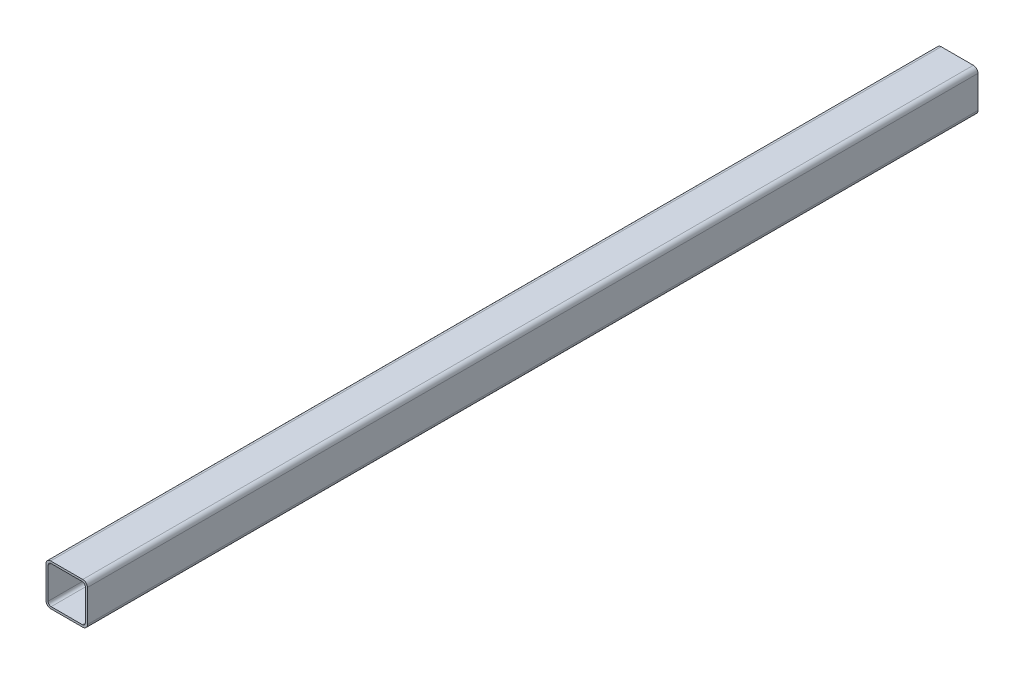
ISO-10303-21;
HEADER;
FILE_DESCRIPTION(('STEP AP214'),'2;1');
FILE_NAME('part.step','',(''),(''),'','','');
FILE_SCHEMA(('AUTOMOTIVE_DESIGN { 1 0 10303 214 1 1 1 1 }'));
ENDSEC;
DATA;
#1=APPLICATION_CONTEXT('core data for automotive mechanical design processes');
#2=APPLICATION_PROTOCOL_DEFINITION('international standard','automotive_design',2000,#1);
#3=PRODUCT_CONTEXT('',#1,'mechanical');
#4=PRODUCT('Part','Part','',(#3));
#5=PRODUCT_RELATED_PRODUCT_CATEGORY('part','',(#4));
#6=PRODUCT_DEFINITION_FORMATION('','',#4);
#7=PRODUCT_DEFINITION_CONTEXT('part definition',#1,'design');
#8=PRODUCT_DEFINITION('design','',#6,#7);
#9=PRODUCT_DEFINITION_SHAPE('','',#8);
#10=(LENGTH_UNIT() NAMED_UNIT(*) SI_UNIT(.MILLI.,.METRE.));
#11=(NAMED_UNIT(*) PLANE_ANGLE_UNIT() SI_UNIT($,.RADIAN.));
#12=(NAMED_UNIT(*) SI_UNIT($,.STERADIAN.) SOLID_ANGLE_UNIT());
#13=UNCERTAINTY_MEASURE_WITH_UNIT(LENGTH_MEASURE(1.E-05),#10,'distance_accuracy_value','');
#14=(GEOMETRIC_REPRESENTATION_CONTEXT(3) GLOBAL_UNCERTAINTY_ASSIGNED_CONTEXT((#13)) GLOBAL_UNIT_ASSIGNED_CONTEXT((#10,
#11,#12)) REPRESENTATION_CONTEXT('',''));
#15=CARTESIAN_POINT('',(0.,0.,0.));
#16=DIRECTION('',(0.,0.,1.));
#17=DIRECTION('',(1.,0.,0.));
#18=AXIS2_PLACEMENT_3D('',#15,#16,#17);
#19=CARTESIAN_POINT('',(-14.9999999999997,1532.00000000001,-900.000000000004));
#20=DIRECTION('',(0.,0.,1.));
#21=DIRECTION('',(0.999999999999997,0.,0.));
#22=AXIS2_PLACEMENT_3D('',#19,#20,#21);
#23=CYLINDRICAL_SURFACE('',#22,3.);
#24=DIRECTION('',(0.,0.,1.));
#25=VECTOR('',#24,1.);
#26=CARTESIAN_POINT('',(-14.9999999999997,1529.00000000001,-900.000000000004));
#27=LINE('',#26,#25);
#28=CARTESIAN_POINT('',(-14.9999999999997,1529.00000000001,-880.000000000004));
#29=VERTEX_POINT('',#28);
#30=CARTESIAN_POINT('',(-14.9999999999997,1529.00000000001,-20.0000000000049));
#31=VERTEX_POINT('',#30);
#32=EDGE_CURVE('E240',#29,#31,#27,.T.);
#33=ORIENTED_EDGE('',*,*,#32,.F.);
#34=CARTESIAN_POINT('',(-14.9999999999997,1532.00000000001,-880.000000000004));
#35=DIRECTION('',(0.,0.,-1.));
#36=DIRECTION('',(0.,1.00000000000001,0.));
#37=AXIS2_PLACEMENT_3D('',#34,#35,#36);
#38=CIRCLE('',#37,3.);
#39=CARTESIAN_POINT('',(-17.9999999999996,1532.00000000001,-880.000000000004));
#40=VERTEX_POINT('',#39);
#41=EDGE_CURVE('E232',#29,#40,#38,.T.);
#42=ORIENTED_EDGE('',*,*,#41,.T.);
#43=DIRECTION('',(0.,0.,1.));
#44=VECTOR('',#43,1.);
#45=CARTESIAN_POINT('',(-17.9999999999998,1532.00000000001,-900.000000000004));
#46=LINE('',#45,#44);
#47=CARTESIAN_POINT('',(-17.9999999999998,1532.00000000001,-20.0000000000029));
#48=VERTEX_POINT('',#47);
#49=EDGE_CURVE('E46',#40,#48,#46,.T.);
#50=ORIENTED_EDGE('',*,*,#49,.T.);
#51=CARTESIAN_POINT('',(-14.9999999999997,1532.00000000001,-20.0000000000049));
#52=DIRECTION('',(0.,0.,1.));
#53=DIRECTION('',(0.999999999999997,0.,0.));
#54=AXIS2_PLACEMENT_3D('',#51,#52,#53);
#55=CIRCLE('',#54,3.);
#56=EDGE_CURVE('E198',#48,#31,#55,.T.);
#57=ORIENTED_EDGE('',*,*,#56,.T.);
#58=EDGE_LOOP('',(#33,#42,#50,#57));
#59=FACE_BOUND('',#58,.T.);
#60=ADVANCED_FACE('F43',(#59),#23,.F.);
#61=CARTESIAN_POINT('',(-14.9999999999997,1529.00000000001,-900.000000000004));
#62=DIRECTION('',(0.,1.00000000000001,0.));
#63=DIRECTION('',(0.,0.,1.));
#64=AXIS2_PLACEMENT_3D('',#61,#62,#63);
#65=PLANE('',#64);
#66=DIRECTION('',(0.,0.,1.));
#67=VECTOR('',#66,1.);
#68=CARTESIAN_POINT('',(15.0000000000003,1529.00000000001,-900.000000000004));
#69=LINE('',#68,#67);
#70=CARTESIAN_POINT('',(15.0000000000003,1529.00000000001,-880.000000000004));
#71=VERTEX_POINT('',#70);
#72=CARTESIAN_POINT('',(15.0000000000003,1529.00000000001,-20.0000000000029));
#73=VERTEX_POINT('',#72);
#74=EDGE_CURVE('E245',#71,#73,#69,.T.);
#75=ORIENTED_EDGE('',*,*,#74,.F.);
#76=DIRECTION('',(-0.999999999999997,0.,0.));
#77=VECTOR('',#76,1.);
#78=CARTESIAN_POINT('',(-14.9999999999997,1529.00000000001,-880.000000000004));
#79=LINE('',#78,#77);
#80=EDGE_CURVE('E236',#71,#29,#79,.T.);
#81=ORIENTED_EDGE('',*,*,#80,.T.);
#82=ORIENTED_EDGE('',*,*,#32,.T.);
#83=DIRECTION('',(0.999999999999997,0.,0.));
#84=VECTOR('',#83,1.);
#85=CARTESIAN_POINT('',(-14.9999999999997,1529.00000000001,-20.0000000000049));
#86=LINE('',#85,#84);
#87=EDGE_CURVE('E246',#31,#73,#86,.T.);
#88=ORIENTED_EDGE('',*,*,#87,.T.);
#89=EDGE_LOOP('',(#75,#81,#82,#88));
#90=FACE_BOUND('',#89,.T.);
#91=ADVANCED_FACE('F415',(#90),#65,.T.);
#92=CARTESIAN_POINT('',(15.0000000000003,1532.00000000001,-900.000000000004));
#93=DIRECTION('',(0.,0.,1.));
#94=DIRECTION('',(0.999999999999997,0.,0.));
#95=AXIS2_PLACEMENT_3D('',#92,#93,#94);
#96=CYLINDRICAL_SURFACE('',#95,3.);
#97=DIRECTION('',(0.,0.,1.));
#98=VECTOR('',#97,1.);
#99=CARTESIAN_POINT('',(18.0000000000002,1532.00000000001,-900.000000000004));
#100=LINE('',#99,#98);
#101=CARTESIAN_POINT('',(18.0000000000002,1532.00000000001,-880.000000000004));
#102=VERTEX_POINT('',#101);
#103=CARTESIAN_POINT('',(18.0000000000002,1532.00000000001,-20.0000000000029));
#104=VERTEX_POINT('',#103);
#105=EDGE_CURVE('E251',#102,#104,#100,.T.);
#106=ORIENTED_EDGE('',*,*,#105,.F.);
#107=CARTESIAN_POINT('',(15.0000000000003,1532.00000000001,-880.000000000004));
#108=DIRECTION('',(0.,0.,-1.));
#109=DIRECTION('',(0.,1.00000000000001,0.));
#110=AXIS2_PLACEMENT_3D('',#107,#108,#109);
#111=CIRCLE('',#110,3.);
#112=EDGE_CURVE('E241',#102,#71,#111,.T.);
#113=ORIENTED_EDGE('',*,*,#112,.T.);
#114=ORIENTED_EDGE('',*,*,#74,.T.);
#115=CARTESIAN_POINT('',(15.0000000000003,1532.00000000001,-20.0000000000029));
#116=DIRECTION('',(0.,0.,1.));
#117=DIRECTION('',(0.999999999999997,0.,0.));
#118=AXIS2_PLACEMENT_3D('',#115,#116,#117);
#119=CIRCLE('',#118,3.);
#120=EDGE_CURVE('E252',#73,#104,#119,.T.);
#121=ORIENTED_EDGE('',*,*,#120,.T.);
#122=EDGE_LOOP('',(#106,#113,#114,#121));
#123=FACE_BOUND('',#122,.T.);
#124=ADVANCED_FACE('F360',(#123),#96,.F.);
#125=CARTESIAN_POINT('',(18.0000000000002,1532.00000000001,-900.000000000004));
#126=DIRECTION('',(-0.999999999999997,0.,0.));
#127=DIRECTION('',(0.,0.,1.));
#128=AXIS2_PLACEMENT_3D('',#125,#126,#127);
#129=PLANE('',#128);
#130=DIRECTION('',(0.,0.,1.));
#131=VECTOR('',#130,1.);
#132=CARTESIAN_POINT('',(18.,1562.00000000001,-900.000000000004));
#133=LINE('',#132,#131);
#134=CARTESIAN_POINT('',(18.,1562.00000000001,-880.000000000004));
#135=VERTEX_POINT('',#134);
#136=CARTESIAN_POINT('',(18.0000000000002,1562.00000000001,-20.0000000000029));
#137=VERTEX_POINT('',#136);
#138=EDGE_CURVE('E257',#135,#137,#133,.T.);
#139=ORIENTED_EDGE('',*,*,#138,.F.);
#140=DIRECTION('',(0.,-1.00000000000001,0.));
#141=VECTOR('',#140,1.);
#142=CARTESIAN_POINT('',(18.0000000000002,1532.00000000001,-880.000000000004));
#143=LINE('',#142,#141);
#144=EDGE_CURVE('E247',#135,#102,#143,.T.);
#145=ORIENTED_EDGE('',*,*,#144,.T.);
#146=ORIENTED_EDGE('',*,*,#105,.T.);
#147=DIRECTION('',(0.,1.00000000000001,0.));
#148=VECTOR('',#147,1.);
#149=CARTESIAN_POINT('',(18.0000000000002,1532.00000000001,-20.0000000000029));
#150=LINE('',#149,#148);
#151=EDGE_CURVE('E258',#104,#137,#150,.T.);
#152=ORIENTED_EDGE('',*,*,#151,.T.);
#153=EDGE_LOOP('',(#139,#145,#146,#152));
#154=FACE_BOUND('',#153,.T.);
#155=ADVANCED_FACE('F357',(#154),#129,.T.);
#156=CARTESIAN_POINT('',(14.9999999999999,1562.00000000001,-900.000000000004));
#157=DIRECTION('',(0.,0.,1.));
#158=DIRECTION('',(0.999999999999997,0.,0.));
#159=AXIS2_PLACEMENT_3D('',#156,#157,#158);
#160=CYLINDRICAL_SURFACE('',#159,3.);
#161=DIRECTION('',(0.,0.,1.));
#162=VECTOR('',#161,1.);
#163=CARTESIAN_POINT('',(14.9999999999999,1565.00000000001,-900.000000000004));
#164=LINE('',#163,#162);
#165=CARTESIAN_POINT('',(15.0000000000001,1565.00000000001,-880.000000000004));
#166=VERTEX_POINT('',#165);
#167=CARTESIAN_POINT('',(15.0000000000001,1565.00000000001,-20.0000000000029));
#168=VERTEX_POINT('',#167);
#169=EDGE_CURVE('E261',#166,#168,#164,.T.);
#170=ORIENTED_EDGE('',*,*,#169,.F.);
#171=CARTESIAN_POINT('',(15.0000000000001,1562.00000000001,-880.000000000004));
#172=DIRECTION('',(0.,0.,-1.));
#173=DIRECTION('',(0.,1.00000000000001,0.));
#174=AXIS2_PLACEMENT_3D('',#171,#172,#173);
#175=CIRCLE('',#174,3.);
#176=EDGE_CURVE('E253',#166,#135,#175,.T.);
#177=ORIENTED_EDGE('',*,*,#176,.T.);
#178=ORIENTED_EDGE('',*,*,#138,.T.);
#179=CARTESIAN_POINT('',(15.0000000000001,1562.00000000001,-20.0000000000029));
#180=DIRECTION('',(0.,0.,1.));
#181=DIRECTION('',(0.999999999999997,0.,0.));
#182=AXIS2_PLACEMENT_3D('',#179,#180,#181);
#183=CIRCLE('',#182,3.);
#184=EDGE_CURVE('E262',#137,#168,#183,.T.);
#185=ORIENTED_EDGE('',*,*,#184,.T.);
#186=EDGE_LOOP('',(#170,#177,#178,#185));
#187=FACE_BOUND('',#186,.T.);
#188=ADVANCED_FACE('F352',(#187),#160,.F.);
#189=CARTESIAN_POINT('',(-15.0000000000001,1565.00000000001,-900.000000000004));
#190=DIRECTION('',(0.,-1.00000000000001,0.));
#191=DIRECTION('',(0.,0.,-1.));
#192=AXIS2_PLACEMENT_3D('',#189,#190,#191);
#193=PLANE('',#192);
#194=DIRECTION('',(0.,0.,1.));
#195=VECTOR('',#194,1.);
#196=CARTESIAN_POINT('',(-15.0000000000001,1565.00000000001,-900.000000000004));
#197=LINE('',#196,#195);
#198=CARTESIAN_POINT('',(-14.9999999999997,1565.00000000001,-880.000000000004));
#199=VERTEX_POINT('',#198);
#200=CARTESIAN_POINT('',(-14.9999999999999,1565.00000000001,-20.0000000000049));
#201=VERTEX_POINT('',#200);
#202=EDGE_CURVE('E265',#199,#201,#197,.T.);
#203=ORIENTED_EDGE('',*,*,#202,.F.);
#204=DIRECTION('',(0.999999999999997,0.,0.));
#205=VECTOR('',#204,1.);
#206=CARTESIAN_POINT('',(-14.9999999999997,1565.00000000001,-880.000000000004));
#207=LINE('',#206,#205);
#208=EDGE_CURVE('E106',#199,#166,#207,.T.);
#209=ORIENTED_EDGE('',*,*,#208,.T.);
#210=ORIENTED_EDGE('',*,*,#169,.T.);
#211=DIRECTION('',(-0.999999999999997,0.,0.));
#212=VECTOR('',#211,1.);
#213=CARTESIAN_POINT('',(-14.9999999999999,1565.00000000001,-20.0000000000049));
#214=LINE('',#213,#212);
#215=EDGE_CURVE('E266',#168,#201,#214,.T.);
#216=ORIENTED_EDGE('',*,*,#215,.T.);
#217=EDGE_LOOP('',(#203,#209,#210,#216));
#218=FACE_BOUND('',#217,.T.);
#219=ADVANCED_FACE('F349',(#218),#193,.T.);
#220=CARTESIAN_POINT('',(-15.0000000000001,1562.00000000001,-900.000000000004));
#221=DIRECTION('',(0.,0.,1.));
#222=DIRECTION('',(0.999999999999997,0.,0.));
#223=AXIS2_PLACEMENT_3D('',#220,#221,#222);
#224=CYLINDRICAL_SURFACE('',#223,3.);
#225=DIRECTION('',(0.,0.,1.));
#226=VECTOR('',#225,1.);
#227=CARTESIAN_POINT('',(-18.,1562.00000000001,-900.000000000004));
#228=LINE('',#227,#226);
#229=CARTESIAN_POINT('',(-17.9999999999998,1562.00000000001,-880.000000000004));
#230=VERTEX_POINT('',#229);
#231=CARTESIAN_POINT('',(-17.9999999999998,1562.00000000001,-20.0000000000029));
#232=VERTEX_POINT('',#231);
#233=EDGE_CURVE('E216',#230,#232,#228,.T.);
#234=ORIENTED_EDGE('',*,*,#233,.F.);
#235=CARTESIAN_POINT('',(-14.9999999999997,1562.00000000001,-880.000000000004));
#236=DIRECTION('',(0.,0.,-1.));
#237=DIRECTION('',(0.,1.00000000000001,0.));
#238=AXIS2_PLACEMENT_3D('',#235,#236,#237);
#239=CIRCLE('',#238,3.);
#240=EDGE_CURVE('E110',#230,#199,#239,.T.);
#241=ORIENTED_EDGE('',*,*,#240,.T.);
#242=ORIENTED_EDGE('',*,*,#202,.T.);
#243=CARTESIAN_POINT('',(-14.9999999999999,1562.00000000001,-20.0000000000049));
#244=DIRECTION('',(0.,0.,1.));
#245=DIRECTION('',(0.999999999999997,0.,0.));
#246=AXIS2_PLACEMENT_3D('',#243,#244,#245);
#247=CIRCLE('',#246,3.);
#248=EDGE_CURVE('E173',#201,#232,#247,.T.);
#249=ORIENTED_EDGE('',*,*,#248,.T.);
#250=EDGE_LOOP('',(#234,#241,#242,#249));
#251=FACE_BOUND('',#250,.T.);
#252=ADVANCED_FACE('F341',(#251),#224,.F.);
#253=CARTESIAN_POINT('',(-15.4999999999996,1531.50000000001,-900.000000000004));
#254=DIRECTION('',(0.,0.,1.));
#255=DIRECTION('',(0.999999999999997,0.,0.));
#256=AXIS2_PLACEMENT_3D('',#253,#254,#255);
#257=CYLINDRICAL_SURFACE('',#256,4.5);
#258=CARTESIAN_POINT('',(-15.4999999999996,1531.50000000001,-880.000000000004));
#259=DIRECTION('',(0.,0.,-1.));
#260=DIRECTION('',(0.,1.00000000000001,0.));
#261=AXIS2_PLACEMENT_3D('',#258,#259,#260);
#262=CIRCLE('',#261,4.5);
#263=CARTESIAN_POINT('',(-15.4999999999996,1527.00000000001,-880.000000000004));
#264=VERTEX_POINT('',#263);
#265=CARTESIAN_POINT('',(-19.9999999999996,1531.50000000001,-880.000000000003));
#266=VERTEX_POINT('',#265);
#267=EDGE_CURVE('E53',#264,#266,#262,.T.);
#268=ORIENTED_EDGE('',*,*,#267,.F.);
#269=DIRECTION('',(0.,0.,1.));
#270=VECTOR('',#269,1.);
#271=CARTESIAN_POINT('',(-15.4999999999998,1527.00000000001,-900.000000000004));
#272=LINE('',#271,#270);
#273=CARTESIAN_POINT('',(-15.4999999999998,1527.00000000001,-20.0000000000029));
#274=VERTEX_POINT('',#273);
#275=EDGE_CURVE('E163',#264,#274,#272,.T.);
#276=ORIENTED_EDGE('',*,*,#275,.T.);
#277=CARTESIAN_POINT('',(-15.4999999999996,1531.50000000001,-20.0000000000029));
#278=DIRECTION('',(0.,0.,1.));
#279=DIRECTION('',(0.999999999999997,0.,0.));
#280=AXIS2_PLACEMENT_3D('',#277,#278,#279);
#281=CIRCLE('',#280,4.5);
#282=CARTESIAN_POINT('',(-19.9999999999998,1531.50000000001,-20.0000000000051));
#283=VERTEX_POINT('',#282);
#284=EDGE_CURVE('E167',#283,#274,#281,.T.);
#285=ORIENTED_EDGE('',*,*,#284,.F.);
#286=DIRECTION('',(0.,0.,1.));
#287=VECTOR('',#286,1.);
#288=CARTESIAN_POINT('',(-19.9999999999998,1531.50000000001,-900.000000000003));
#289=LINE('',#288,#287);
#290=EDGE_CURVE('E172',#266,#283,#289,.T.);
#291=ORIENTED_EDGE('',*,*,#290,.F.);
#292=EDGE_LOOP('',(#268,#276,#285,#291));
#293=FACE_BOUND('',#292,.T.);
#294=ADVANCED_FACE('F165',(#293),#257,.T.);
#295=CARTESIAN_POINT('',(-19.9999999999998,1531.50000000001,-900.000000000003));
#296=DIRECTION('',(0.999999999999997,0.,0.));
#297=DIRECTION('',(0.,0.,-1.));
#298=AXIS2_PLACEMENT_3D('',#295,#296,#297);
#299=PLANE('',#298);
#300=DIRECTION('',(0.,1.00000000000001,0.));
#301=VECTOR('',#300,1.);
#302=CARTESIAN_POINT('',(-20.,1.4432899320127E-12,-880.000000000001));
#303=LINE('',#302,#301);
#304=CARTESIAN_POINT('',(-19.9999999999998,1562.50000000001,-880.000000000003));
#305=VERTEX_POINT('',#304);
#306=EDGE_CURVE('E11',#266,#305,#303,.T.);
#307=ORIENTED_EDGE('',*,*,#306,.F.);
#308=ORIENTED_EDGE('',*,*,#290,.T.);
#309=DIRECTION('',(0.,-1.00000000000001,0.));
#310=VECTOR('',#309,1.);
#311=CARTESIAN_POINT('',(-19.9999999999998,1960.00000000001,-20.0000000000053));
#312=LINE('',#311,#310);
#313=CARTESIAN_POINT('',(-19.9999999999998,1562.50000000001,-20.0000000000051));
#314=VERTEX_POINT('',#313);
#315=EDGE_CURVE('E184',#314,#283,#312,.T.);
#316=ORIENTED_EDGE('',*,*,#315,.F.);
#317=DIRECTION('',(0.,0.,1.));
#318=VECTOR('',#317,1.);
#319=CARTESIAN_POINT('',(-20.,1562.50000000001,-900.000000000003));
#320=LINE('',#319,#318);
#321=EDGE_CURVE('E288',#305,#314,#320,.T.);
#322=ORIENTED_EDGE('',*,*,#321,.F.);
#323=EDGE_LOOP('',(#307,#308,#316,#322));
#324=FACE_BOUND('',#323,.T.);
#325=ADVANCED_FACE('F436',(#324),#299,.F.);
#326=CARTESIAN_POINT('',(-15.5000000000001,1562.50000000001,-900.000000000004));
#327=DIRECTION('',(0.,0.,1.));
#328=DIRECTION('',(0.999999999999997,0.,0.));
#329=AXIS2_PLACEMENT_3D('',#326,#327,#328);
#330=CYLINDRICAL_SURFACE('',#329,4.5);
#331=CARTESIAN_POINT('',(-15.4999999999998,1562.50000000001,-880.000000000004));
#332=DIRECTION('',(0.,0.,-1.));
#333=DIRECTION('',(0.,1.00000000000001,0.));
#334=AXIS2_PLACEMENT_3D('',#331,#332,#333);
#335=CIRCLE('',#334,4.5);
#336=CARTESIAN_POINT('',(-15.4999999999998,1567.00000000001,-880.000000000004));
#337=VERTEX_POINT('',#336);
#338=EDGE_CURVE('E208',#305,#337,#335,.T.);
#339=ORIENTED_EDGE('',*,*,#338,.F.);
#340=ORIENTED_EDGE('',*,*,#321,.T.);
#341=CARTESIAN_POINT('',(-15.4999999999998,1562.50000000001,-20.0000000000029));
#342=DIRECTION('',(0.,0.,1.));
#343=DIRECTION('',(0.999999999999997,0.,0.));
#344=AXIS2_PLACEMENT_3D('',#341,#342,#343);
#345=CIRCLE('',#344,4.5);
#346=CARTESIAN_POINT('',(-15.4999999999998,1567.00000000001,-20.0000000000029));
#347=VERTEX_POINT('',#346);
#348=EDGE_CURVE('E209',#347,#314,#345,.T.);
#349=ORIENTED_EDGE('',*,*,#348,.F.);
#350=DIRECTION('',(0.,0.,1.));
#351=VECTOR('',#350,1.);
#352=CARTESIAN_POINT('',(-15.5000000000001,1567.00000000001,-900.000000000004));
#353=LINE('',#352,#351);
#354=EDGE_CURVE('E285',#337,#347,#353,.T.);
#355=ORIENTED_EDGE('',*,*,#354,.F.);
#356=EDGE_LOOP('',(#339,#340,#349,#355));
#357=FACE_BOUND('',#356,.T.);
#358=ADVANCED_FACE('F439',(#357),#330,.T.);
#359=CARTESIAN_POINT('',(-15.5000000000001,1567.00000000001,-900.000000000004));
#360=DIRECTION('',(0.,-1.00000000000001,0.));
#361=DIRECTION('',(0.,0.,-1.));
#362=AXIS2_PLACEMENT_3D('',#359,#360,#361);
#363=PLANE('',#362);
#364=DIRECTION('',(0.999999999999997,0.,0.));
#365=VECTOR('',#364,1.);
#366=CARTESIAN_POINT('',(-15.4999999999998,1567.00000000001,-880.000000000004));
#367=LINE('',#366,#365);
#368=CARTESIAN_POINT('',(15.5000000000003,1567.00000000001,-880.000000000004));
#369=VERTEX_POINT('',#368);
#370=EDGE_CURVE('E79',#337,#369,#367,.T.);
#371=ORIENTED_EDGE('',*,*,#370,.F.);
#372=ORIENTED_EDGE('',*,*,#354,.T.);
#373=DIRECTION('',(-0.999999999999997,0.,0.));
#374=VECTOR('',#373,1.);
#375=CARTESIAN_POINT('',(-15.4999999999998,1567.00000000001,-20.0000000000029));
#376=LINE('',#375,#374);
#377=CARTESIAN_POINT('',(15.5000000000003,1567.00000000001,-20.0000000000029));
#378=VERTEX_POINT('',#377);
#379=EDGE_CURVE('E204',#378,#347,#376,.T.);
#380=ORIENTED_EDGE('',*,*,#379,.F.);
#381=DIRECTION('',(0.,0.,1.));
#382=VECTOR('',#381,1.);
#383=CARTESIAN_POINT('',(15.5000000000001,1567.00000000001,-900.000000000004));
#384=LINE('',#383,#382);
#385=EDGE_CURVE('E270',#369,#378,#384,.T.);
#386=ORIENTED_EDGE('',*,*,#385,.F.);
#387=EDGE_LOOP('',(#371,#372,#380,#386));
#388=FACE_BOUND('',#387,.T.);
#389=ADVANCED_FACE('F443',(#388),#363,.F.);
#390=CARTESIAN_POINT('',(15.4999999999998,1562.50000000001,-900.000000000004));
#391=DIRECTION('',(0.,0.,1.));
#392=DIRECTION('',(0.999999999999997,0.,0.));
#393=AXIS2_PLACEMENT_3D('',#390,#391,#392);
#394=CYLINDRICAL_SURFACE('',#393,4.5);
#395=CARTESIAN_POINT('',(15.5000000000003,1562.50000000001,-880.000000000004));
#396=DIRECTION('',(0.,0.,-1.));
#397=DIRECTION('',(0.,1.00000000000001,0.));
#398=AXIS2_PLACEMENT_3D('',#395,#396,#397);
#399=CIRCLE('',#398,4.5);
#400=CARTESIAN_POINT('',(20.,1562.50000000001,-880.000000000003));
#401=VERTEX_POINT('',#400);
#402=EDGE_CURVE('E73',#369,#401,#399,.T.);
#403=ORIENTED_EDGE('',*,*,#402,.F.);
#404=ORIENTED_EDGE('',*,*,#385,.T.);
#405=CARTESIAN_POINT('',(15.5000000000001,1562.50000000001,-20.0000000000029));
#406=DIRECTION('',(0.,0.,1.));
#407=DIRECTION('',(0.999999999999997,0.,0.));
#408=AXIS2_PLACEMENT_3D('',#405,#406,#407);
#409=CIRCLE('',#408,4.5);
#410=CARTESIAN_POINT('',(20.0000000000002,1562.50000000001,-20.0000000000029));
#411=VERTEX_POINT('',#410);
#412=EDGE_CURVE('E195',#411,#378,#409,.T.);
#413=ORIENTED_EDGE('',*,*,#412,.F.);
#414=DIRECTION('',(0.,0.,1.));
#415=VECTOR('',#414,1.);
#416=CARTESIAN_POINT('',(20.,1562.50000000001,-900.000000000003));
#417=LINE('',#416,#415);
#418=EDGE_CURVE('E269',#401,#411,#417,.T.);
#419=ORIENTED_EDGE('',*,*,#418,.F.);
#420=EDGE_LOOP('',(#403,#404,#413,#419));
#421=FACE_BOUND('',#420,.T.);
#422=ADVANCED_FACE('F447',(#421),#394,.T.);
#423=CARTESIAN_POINT('',(20.0000000000002,1531.50000000001,-900.000000000003));
#424=DIRECTION('',(-0.999999999999997,0.,0.));
#425=DIRECTION('',(0.,0.,1.));
#426=AXIS2_PLACEMENT_3D('',#423,#424,#425);
#427=PLANE('',#426);
#428=DIRECTION('',(0.,1.00000000000001,0.));
#429=VECTOR('',#428,1.);
#430=CARTESIAN_POINT('',(19.9999999999998,4.44089209850063E-13,-880.));
#431=LINE('',#430,#429);
#432=CARTESIAN_POINT('',(20.0000000000002,1531.50000000001,-880.000000000003));
#433=VERTEX_POINT('',#432);
#434=EDGE_CURVE('E267',#433,#401,#431,.T.);
#435=ORIENTED_EDGE('',*,*,#434,.T.);
#436=ORIENTED_EDGE('',*,*,#418,.T.);
#437=DIRECTION('',(0.,-1.00000000000001,0.));
#438=VECTOR('',#437,1.);
#439=CARTESIAN_POINT('',(20.0000000000002,1960.00000000001,-20.0000000000031));
#440=LINE('',#439,#438);
#441=CARTESIAN_POINT('',(20.0000000000002,1531.50000000001,-20.0000000000029));
#442=VERTEX_POINT('',#441);
#443=EDGE_CURVE('E280',#411,#442,#440,.T.);
#444=ORIENTED_EDGE('',*,*,#443,.T.);
#445=DIRECTION('',(0.,0.,1.));
#446=VECTOR('',#445,1.);
#447=CARTESIAN_POINT('',(20.0000000000002,1531.50000000001,-900.000000000003));
#448=LINE('',#447,#446);
#449=EDGE_CURVE('E277',#433,#442,#448,.T.);
#450=ORIENTED_EDGE('',*,*,#449,.F.);
#451=EDGE_LOOP('',(#435,#436,#444,#450));
#452=FACE_BOUND('',#451,.T.);
#453=ADVANCED_FACE('F451',(#452),#427,.F.);
#454=CARTESIAN_POINT('',(15.5000000000003,1531.50000000001,-900.000000000004));
#455=DIRECTION('',(0.,0.,1.));
#456=DIRECTION('',(0.999999999999997,0.,0.));
#457=AXIS2_PLACEMENT_3D('',#454,#455,#456);
#458=CYLINDRICAL_SURFACE('',#457,4.5);
#459=CARTESIAN_POINT('',(15.5000000000003,1531.50000000001,-880.000000000004));
#460=DIRECTION('',(0.,0.,-1.));
#461=DIRECTION('',(0.,1.00000000000001,0.));
#462=AXIS2_PLACEMENT_3D('',#459,#460,#461);
#463=CIRCLE('',#462,4.5);
#464=CARTESIAN_POINT('',(15.5000000000003,1527.00000000001,-880.000000000004));
#465=VERTEX_POINT('',#464);
#466=EDGE_CURVE('E223',#433,#465,#463,.T.);
#467=ORIENTED_EDGE('',*,*,#466,.F.);
#468=ORIENTED_EDGE('',*,*,#449,.T.);
#469=CARTESIAN_POINT('',(15.5000000000003,1531.50000000001,-20.0000000000029));
#470=DIRECTION('',(0.,0.,1.));
#471=DIRECTION('',(0.999999999999997,0.,0.));
#472=AXIS2_PLACEMENT_3D('',#469,#470,#471);
#473=CIRCLE('',#472,4.5);
#474=CARTESIAN_POINT('',(15.5000000000003,1527.00000000001,-20.0000000000029));
#475=VERTEX_POINT('',#474);
#476=EDGE_CURVE('E191',#475,#442,#473,.T.);
#477=ORIENTED_EDGE('',*,*,#476,.F.);
#478=DIRECTION('',(0.,0.,1.));
#479=VECTOR('',#478,1.);
#480=CARTESIAN_POINT('',(15.5000000000003,1527.00000000001,-900.000000000004));
#481=LINE('',#480,#479);
#482=EDGE_CURVE('E189',#465,#475,#481,.T.);
#483=ORIENTED_EDGE('',*,*,#482,.F.);
#484=EDGE_LOOP('',(#467,#468,#477,#483));
#485=FACE_BOUND('',#484,.T.);
#486=ADVANCED_FACE('F455',(#485),#458,.T.);
#487=CARTESIAN_POINT('',(-15.4999999999998,1527.00000000001,-900.000000000004));
#488=DIRECTION('',(0.,1.00000000000001,0.));
#489=DIRECTION('',(0.,0.,1.));
#490=AXIS2_PLACEMENT_3D('',#487,#488,#489);
#491=PLANE('',#490);
#492=DIRECTION('',(-0.999999999999997,0.,0.));
#493=VECTOR('',#492,1.);
#494=CARTESIAN_POINT('',(-15.4999999999996,1527.00000000001,-880.000000000004));
#495=LINE('',#494,#493);
#496=EDGE_CURVE('E226',#465,#264,#495,.T.);
#497=ORIENTED_EDGE('',*,*,#496,.F.);
#498=ORIENTED_EDGE('',*,*,#482,.T.);
#499=DIRECTION('',(0.999999999999997,0.,0.));
#500=VECTOR('',#499,1.);
#501=CARTESIAN_POINT('',(-15.4999999999998,1527.00000000001,-20.0000000000029));
#502=LINE('',#501,#500);
#503=EDGE_CURVE('E181',#274,#475,#502,.T.);
#504=ORIENTED_EDGE('',*,*,#503,.F.);
#505=ORIENTED_EDGE('',*,*,#275,.F.);
#506=EDGE_LOOP('',(#497,#498,#504,#505));
#507=FACE_BOUND('',#506,.T.);
#508=ADVANCED_FACE('F187',(#507),#491,.F.);
#509=CARTESIAN_POINT('',(-17.9999999999998,1532.00000000001,-900.000000000004));
#510=DIRECTION('',(0.999999999999997,0.,0.));
#511=DIRECTION('',(0.,0.,-1.));
#512=AXIS2_PLACEMENT_3D('',#509,#510,#511);
#513=PLANE('',#512);
#514=ORIENTED_EDGE('',*,*,#49,.F.);
#515=DIRECTION('',(0.,1.00000000000001,0.));
#516=VECTOR('',#515,1.);
#517=CARTESIAN_POINT('',(-17.9999999999996,1532.00000000001,-880.000000000004));
#518=LINE('',#517,#516);
#519=EDGE_CURVE('E274',#40,#230,#518,.T.);
#520=ORIENTED_EDGE('',*,*,#519,.T.);
#521=ORIENTED_EDGE('',*,*,#233,.T.);
#522=DIRECTION('',(0.,-1.00000000000001,0.));
#523=VECTOR('',#522,1.);
#524=CARTESIAN_POINT('',(-17.9999999999998,1532.00000000001,-20.0000000000029));
#525=LINE('',#524,#523);
#526=EDGE_CURVE('E212',#232,#48,#525,.T.);
#527=ORIENTED_EDGE('',*,*,#526,.T.);
#528=EDGE_LOOP('',(#514,#520,#521,#527));
#529=FACE_BOUND('',#528,.T.);
#530=ADVANCED_FACE('F338',(#529),#513,.T.);
#531=CARTESIAN_POINT('',(-15.4999999999998,1960.00000000001,-20.0000000000031));
#532=DIRECTION('',(0.,0.,1.));
#533=DIRECTION('',(0.999999999999997,0.,0.));
#534=AXIS2_PLACEMENT_3D('',#531,#532,#533);
#535=PLANE('',#534);
#536=ORIENTED_EDGE('',*,*,#526,.F.);
#537=ORIENTED_EDGE('',*,*,#248,.F.);
#538=ORIENTED_EDGE('',*,*,#215,.F.);
#539=ORIENTED_EDGE('',*,*,#184,.F.);
#540=ORIENTED_EDGE('',*,*,#151,.F.);
#541=ORIENTED_EDGE('',*,*,#120,.F.);
#542=ORIENTED_EDGE('',*,*,#87,.F.);
#543=ORIENTED_EDGE('',*,*,#56,.F.);
#544=EDGE_LOOP('',(#536,#537,#538,#539,#540,#541,#542,#543));
#545=FACE_BOUND('',#544,.T.);
#546=ORIENTED_EDGE('',*,*,#348,.T.);
#547=ORIENTED_EDGE('',*,*,#315,.T.);
#548=ORIENTED_EDGE('',*,*,#284,.T.);
#549=ORIENTED_EDGE('',*,*,#503,.T.);
#550=ORIENTED_EDGE('',*,*,#476,.T.);
#551=ORIENTED_EDGE('',*,*,#443,.F.);
#552=ORIENTED_EDGE('',*,*,#412,.T.);
#553=ORIENTED_EDGE('',*,*,#379,.T.);
#554=EDGE_LOOP('',(#546,#547,#548,#549,#550,#551,#552,#553));
#555=FACE_BOUND('',#554,.T.);
#556=ADVANCED_FACE('F179',(#545,#555),#535,.T.);
#557=CARTESIAN_POINT('',(-15.5000000000001,1.4432899320127E-12,-880.000000000001));
#558=DIRECTION('',(0.,0.,-1.));
#559=DIRECTION('',(0.,1.00000000000001,0.));
#560=AXIS2_PLACEMENT_3D('',#557,#558,#559);
#561=PLANE('',#560);
#562=ORIENTED_EDGE('',*,*,#80,.F.);
#563=ORIENTED_EDGE('',*,*,#112,.F.);
#564=ORIENTED_EDGE('',*,*,#144,.F.);
#565=ORIENTED_EDGE('',*,*,#176,.F.);
#566=ORIENTED_EDGE('',*,*,#208,.F.);
#567=ORIENTED_EDGE('',*,*,#240,.F.);
#568=ORIENTED_EDGE('',*,*,#519,.F.);
#569=ORIENTED_EDGE('',*,*,#41,.F.);
#570=EDGE_LOOP('',(#562,#563,#564,#565,#566,#567,#568,#569));
#571=FACE_BOUND('',#570,.T.);
#572=ORIENTED_EDGE('',*,*,#338,.T.);
#573=ORIENTED_EDGE('',*,*,#370,.T.);
#574=ORIENTED_EDGE('',*,*,#402,.T.);
#575=ORIENTED_EDGE('',*,*,#434,.F.);
#576=ORIENTED_EDGE('',*,*,#466,.T.);
#577=ORIENTED_EDGE('',*,*,#496,.T.);
#578=ORIENTED_EDGE('',*,*,#267,.T.);
#579=ORIENTED_EDGE('',*,*,#306,.T.);
#580=EDGE_LOOP('',(#572,#573,#574,#575,#576,#577,#578,#579));
#581=FACE_BOUND('',#580,.T.);
#582=ADVANCED_FACE('F414',(#571,#581),#561,.T.);
#583=CLOSED_SHELL('',(#60,#91,#124,#155,#188,#219,#252,#294,#325,#358,#389,#422,#453,#486,#508,
#530,#556,#582));
#584=MANIFOLD_SOLID_BREP('B2',#583);
#585=ADVANCED_BREP_SHAPE_REPRESENTATION('',(#18,#584),#14);
#586=SHAPE_DEFINITION_REPRESENTATION(#9,#585);
ENDSEC;
END-ISO-10303-21;
